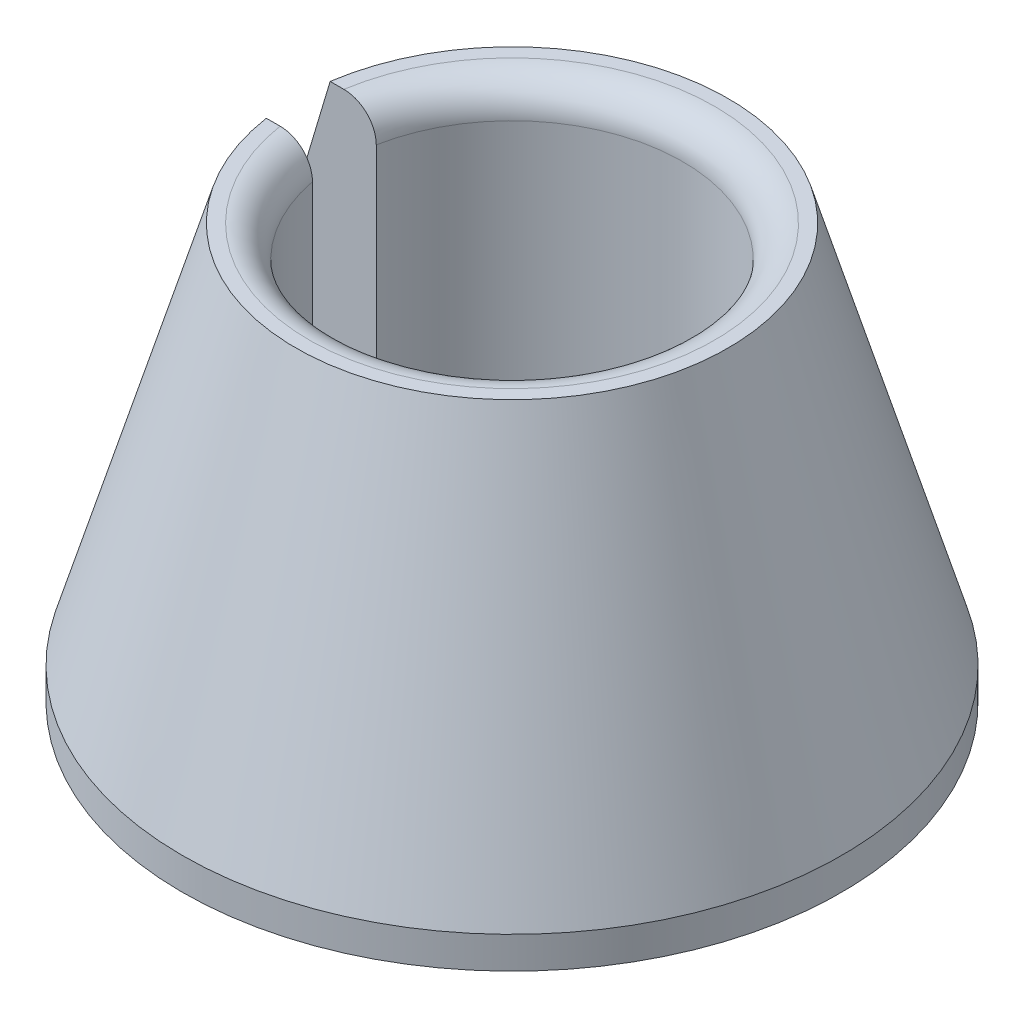
ISO-10303-21;
HEADER;
FILE_DESCRIPTION(('STEP AP214'),'2;1');
FILE_NAME('part.step','',(''),(''),'','','');
FILE_SCHEMA(('AUTOMOTIVE_DESIGN { 1 0 10303 214 1 1 1 1 }'));
ENDSEC;
DATA;
#1=APPLICATION_CONTEXT('core data for automotive mechanical design processes');
#2=APPLICATION_PROTOCOL_DEFINITION('international standard','automotive_design',2000,#1);
#3=PRODUCT_CONTEXT('',#1,'mechanical');
#4=PRODUCT('Part','Part','',(#3));
#5=PRODUCT_RELATED_PRODUCT_CATEGORY('part','',(#4));
#6=PRODUCT_DEFINITION_FORMATION('','',#4);
#7=PRODUCT_DEFINITION_CONTEXT('part definition',#1,'design');
#8=PRODUCT_DEFINITION('design','',#6,#7);
#9=PRODUCT_DEFINITION_SHAPE('','',#8);
#10=(LENGTH_UNIT() NAMED_UNIT(*) SI_UNIT(.MILLI.,.METRE.));
#11=(NAMED_UNIT(*) PLANE_ANGLE_UNIT() SI_UNIT($,.RADIAN.));
#12=(NAMED_UNIT(*) SI_UNIT($,.STERADIAN.) SOLID_ANGLE_UNIT());
#13=UNCERTAINTY_MEASURE_WITH_UNIT(LENGTH_MEASURE(1.E-05),#10,'distance_accuracy_value','');
#14=(GEOMETRIC_REPRESENTATION_CONTEXT(3) GLOBAL_UNCERTAINTY_ASSIGNED_CONTEXT((#13)) GLOBAL_UNIT_ASSIGNED_CONTEXT((#10,
#11,#12)) REPRESENTATION_CONTEXT('',''));
#15=CARTESIAN_POINT('',(0.,0.,0.));
#16=DIRECTION('',(0.,0.,1.));
#17=DIRECTION('',(1.,0.,0.));
#18=AXIS2_PLACEMENT_3D('',#15,#16,#17);
#19=CARTESIAN_POINT('',(0.,6.,0.));
#20=DIRECTION('',(0.,1.,0.));
#21=DIRECTION('',(0.,0.,1.));
#22=AXIS2_PLACEMENT_3D('',#19,#20,#21);
#23=PLANE('',#22);
#24=DIRECTION('',(-1.,0.,0.));
#25=VECTOR('',#24,1.);
#26=CARTESIAN_POINT('',(0.,6.,-0.5));
#27=LINE('',#26,#25);
#28=CARTESIAN_POINT('',(-3.13538275175456,6.,-0.5));
#29=VERTEX_POINT('',#28);
#30=CARTESIAN_POINT('',(-3.35061788745981,6.,-0.499999999999999));
#31=VERTEX_POINT('',#30);
#32=EDGE_CURVE('E111',#29,#31,#27,.T.);
#33=ORIENTED_EDGE('',*,*,#32,.F.);
#34=CARTESIAN_POINT('',(0.,6.,0.));
#35=DIRECTION('',(0.,1.,0.));
#36=DIRECTION('',(0.,0.,1.));
#37=AXIS2_PLACEMENT_3D('',#34,#35,#36);
#38=CIRCLE('',#37,3.175);
#39=CARTESIAN_POINT('',(-3.13538275175456,6.,0.5));
#40=VERTEX_POINT('',#39);
#41=EDGE_CURVE('E11',#29,#40,#38,.F.);
#42=ORIENTED_EDGE('',*,*,#41,.T.);
#43=DIRECTION('',(1.,0.,0.));
#44=VECTOR('',#43,1.);
#45=CARTESIAN_POINT('',(0.,6.,0.5));
#46=LINE('',#45,#44);
#47=CARTESIAN_POINT('',(-3.35061788745981,6.,0.5));
#48=VERTEX_POINT('',#47);
#49=EDGE_CURVE('E123',#48,#40,#46,.T.);
#50=ORIENTED_EDGE('',*,*,#49,.F.);
#51=CARTESIAN_POINT('',(0.,6.,0.));
#52=DIRECTION('',(0.,1.,0.));
#53=DIRECTION('',(0.,0.,1.));
#54=AXIS2_PLACEMENT_3D('',#51,#52,#53);
#55=CIRCLE('',#54,3.38771903022752);
#56=EDGE_CURVE('E132',#48,#31,#55,.T.);
#57=ORIENTED_EDGE('',*,*,#56,.T.);
#58=EDGE_LOOP('',(#33,#42,#50,#57));
#59=FACE_BOUND('',#58,.T.);
#60=ADVANCED_FACE('F30',(#59),#23,.T.);
#61=CARTESIAN_POINT('',(0.,6.,0.));
#62=DIRECTION('',(0.,-1.,0.));
#63=DIRECTION('',(0.,0.,-1.));
#64=AXIS2_PLACEMENT_3D('',#61,#62,#63);
#65=CYLINDRICAL_SURFACE('',#64,2.675);
#66=DIRECTION('',(0.,-1.,0.));
#67=VECTOR('',#66,1.);
#68=CARTESIAN_POINT('',(-2.62785558963958,6.,-0.5));
#69=LINE('',#68,#67);
#70=CARTESIAN_POINT('',(-2.62785558963958,0.,-0.5));
#71=VERTEX_POINT('',#70);
#72=CARTESIAN_POINT('',(-2.62785558963958,5.5,-0.5));
#73=VERTEX_POINT('',#72);
#74=EDGE_CURVE('E125',#71,#73,#69,.F.);
#75=ORIENTED_EDGE('',*,*,#74,.F.);
#76=CARTESIAN_POINT('',(0.,0.,0.));
#77=DIRECTION('',(0.,-1.,0.));
#78=DIRECTION('',(0.,0.,-1.));
#79=AXIS2_PLACEMENT_3D('',#76,#77,#78);
#80=CIRCLE('',#79,2.675);
#81=CARTESIAN_POINT('',(-2.62785558963958,0.,0.5));
#82=VERTEX_POINT('',#81);
#83=EDGE_CURVE('E52',#71,#82,#80,.T.);
#84=ORIENTED_EDGE('',*,*,#83,.T.);
#85=DIRECTION('',(0.,-1.,0.));
#86=VECTOR('',#85,1.);
#87=CARTESIAN_POINT('',(-2.62785558963958,6.,0.5));
#88=LINE('',#87,#86);
#89=CARTESIAN_POINT('',(-2.62785558963958,5.5,0.5));
#90=VERTEX_POINT('',#89);
#91=EDGE_CURVE('E128',#90,#82,#88,.T.);
#92=ORIENTED_EDGE('',*,*,#91,.F.);
#93=CARTESIAN_POINT('',(0.,5.5,0.));
#94=DIRECTION('',(0.,1.,0.));
#95=DIRECTION('',(0.,0.,1.));
#96=AXIS2_PLACEMENT_3D('',#93,#94,#95);
#97=CIRCLE('',#96,2.675);
#98=EDGE_CURVE('E199',#90,#73,#97,.T.);
#99=ORIENTED_EDGE('',*,*,#98,.T.);
#100=EDGE_LOOP('',(#75,#84,#92,#99));
#101=FACE_BOUND('',#100,.T.);
#102=ADVANCED_FACE('F153',(#101),#65,.F.);
#103=CARTESIAN_POINT('',(0.,6.,0.));
#104=DIRECTION('',(0.,-1.,0.));
#105=DIRECTION('',(0.,0.,-1.));
#106=AXIS2_PLACEMENT_3D('',#103,#104,#105);
#107=CONICAL_SURFACE('',#106,3.38771903022752,0.287979326579061);
#108=CARTESIAN_POINT('',(-7.06461862821965,-6.47266368919501,0.500000000000001));
#109=CARTESIAN_POINT('',(-6.70170207394919,-5.25062863502124,0.500000000000001));
#110=CARTESIAN_POINT('',(-6.33870617517651,-4.02861711105922,0.500000000000001));
#111=CARTESIAN_POINT('',(-5.61227249703137,-1.58471010621999,0.500000000000001));
#112=CARTESIAN_POINT('',(-5.2488347126165,-0.362814626841809,0.500000000000001));
#113=CARTESIAN_POINT('',(-4.52124265636424,2.08076235395059,0.500000000000001));
#114=CARTESIAN_POINT('',(-4.15708838499153,3.30244385550302,0.5));
#115=CARTESIAN_POINT('',(-3.60967078608585,5.13460575842493,0.5));
#116=CARTESIAN_POINT('',(-3.42700138317681,5.74526357395898,0.5));
#117=CARTESIAN_POINT('',(-3.06102299099385,6.96638853554709,0.5));
#118=CARTESIAN_POINT('',(-2.87771400094058,7.57685568136784,0.5));
#119=CARTESIAN_POINT('',(-2.57805380496822,8.57149014649971,0.5));
#120=CARTESIAN_POINT('',(-2.46204035942895,8.9557591954713,0.5));
#121=CARTESIAN_POINT('',(-2.22934094908726,9.72409247175238,0.5));
#122=CARTESIAN_POINT('',(-2.11265498660099,10.1081566997623,0.5));
#123=CARTESIAN_POINT('',(-1.93680490403009,10.6840057135758,0.5));
#124=CARTESIAN_POINT('',(-1.8780508852313,10.875915680973,0.5));
#125=CARTESIAN_POINT('',(-1.76017631875048,11.2596227257773,0.5));
#126=CARTESIAN_POINT('',(-1.70105577163703,11.451419803359,0.5));
#127=CARTESIAN_POINT('',(-1.58232680130916,11.8348655530353,0.5));
#128=CARTESIAN_POINT('',(-1.52271837261131,12.0265142234353,0.5));
#129=CARTESIAN_POINT('',(-1.40278787177882,12.409589122013,0.5));
#130=CARTESIAN_POINT('',(-1.34246579579467,12.6010153489846,0.5));
#131=CARTESIAN_POINT('',(-1.28167400377119,12.7922933816177,0.5));
#132=B_SPLINE_CURVE_WITH_KNOTS('',3,(#108,#109,#110,#111,#112,#113,#114,#115,#116,#117,#118,
#119,#120,#121,#122,#123,#124,#125,#126,#127,#128,#129,#130,#131),.UNSPECIFIED.,.F.,.F.,(4,2,2,
2,2,2,2,2,2,2,2,4),(0.,3.82435655263982,7.64875716273367,11.473155293271,13.3853370651035,
15.2975211677566,16.5017203408209,17.7059153691098,18.3080224115717,18.9101285202323,
19.5122414054505,20.1143575400337),.UNSPECIFIED.);
#133=CARTESIAN_POINT('',(-5.14074167800717,0.,0.500000000000003));
#134=VERTEX_POINT('',#133);
#135=EDGE_CURVE('E141',#134,#48,#132,.T.);
#136=ORIENTED_EDGE('',*,*,#135,.F.);
#137=CARTESIAN_POINT('',(0.,0.,0.));
#138=DIRECTION('',(0.,1.,0.));
#139=DIRECTION('',(0.,0.,1.));
#140=AXIS2_PLACEMENT_3D('',#137,#138,#139);
#141=CIRCLE('',#140,5.165);
#142=CARTESIAN_POINT('',(-5.14074167800715,0.,-0.499999999999999));
#143=VERTEX_POINT('',#142);
#144=EDGE_CURVE('E130',#134,#143,#141,.T.);
#145=ORIENTED_EDGE('',*,*,#144,.T.);
#146=CARTESIAN_POINT('',(-7.06461862821965,-6.47266368919501,-0.499999999999999));
#147=CARTESIAN_POINT('',(-6.70170207394919,-5.25062863502124,-0.499999999999999));
#148=CARTESIAN_POINT('',(-6.33870617517651,-4.02861711105922,-0.499999999999999));
#149=CARTESIAN_POINT('',(-5.61227249703137,-1.58471010621999,-0.499999999999999));
#150=CARTESIAN_POINT('',(-5.2488347126165,-0.362814626841809,-0.499999999999999));
#151=CARTESIAN_POINT('',(-4.52124265636424,2.08076235395059,-0.499999999999999));
#152=CARTESIAN_POINT('',(-4.15708838499153,3.30244385550302,-0.5));
#153=CARTESIAN_POINT('',(-3.60967078608585,5.13460575842493,-0.5));
#154=CARTESIAN_POINT('',(-3.42700138317681,5.74526357395898,-0.5));
#155=CARTESIAN_POINT('',(-3.06102299099385,6.96638853554709,-0.5));
#156=CARTESIAN_POINT('',(-2.87771400094058,7.57685568136784,-0.5));
#157=CARTESIAN_POINT('',(-2.57805380496822,8.57149014649971,-0.5));
#158=CARTESIAN_POINT('',(-2.46204035942895,8.9557591954713,-0.5));
#159=CARTESIAN_POINT('',(-2.22934094908726,9.72409247175238,-0.5));
#160=CARTESIAN_POINT('',(-2.11265498660099,10.1081566997623,-0.5));
#161=CARTESIAN_POINT('',(-1.93680490403009,10.6840057135758,-0.5));
#162=CARTESIAN_POINT('',(-1.8780508852313,10.875915680973,-0.5));
#163=CARTESIAN_POINT('',(-1.76017631875048,11.2596227257773,-0.5));
#164=CARTESIAN_POINT('',(-1.70105577163703,11.451419803359,-0.5));
#165=CARTESIAN_POINT('',(-1.58232680130916,11.8348655530353,-0.5));
#166=CARTESIAN_POINT('',(-1.52271837261131,12.0265142234353,-0.5));
#167=CARTESIAN_POINT('',(-1.40278787177882,12.409589122013,-0.5));
#168=CARTESIAN_POINT('',(-1.34246579579467,12.6010153489846,-0.5));
#169=CARTESIAN_POINT('',(-1.28167400377119,12.7922933816177,-0.5));
#170=B_SPLINE_CURVE_WITH_KNOTS('',3,(#146,#147,#148,#149,#150,#151,#152,#153,#154,#155,#156,
#157,#158,#159,#160,#161,#162,#163,#164,#165,#166,#167,#168,#169),.UNSPECIFIED.,.F.,.F.,(4,2,2,
2,2,2,2,2,2,2,2,4),(0.,3.82435655263982,7.64875716273367,11.473155293271,13.3853370651035,
15.2975211677566,16.5017203408209,17.7059153691098,18.3080224115717,18.9101285202322,
19.5122414054504,20.1143575400337),.UNSPECIFIED.);
#171=EDGE_CURVE('E108',#31,#143,#170,.F.);
#172=ORIENTED_EDGE('',*,*,#171,.F.);
#173=ORIENTED_EDGE('',*,*,#56,.F.);
#174=EDGE_LOOP('',(#136,#145,#172,#173));
#175=FACE_BOUND('',#174,.T.);
#176=ADVANCED_FACE('F149',(#175),#107,.T.);
#177=CARTESIAN_POINT('',(0.,0.,-0.5));
#178=DIRECTION('',(0.,0.,-1.));
#179=DIRECTION('',(-1.,0.,0.));
#180=AXIS2_PLACEMENT_3D('',#177,#178,#179);
#181=PLANE('',#180);
#182=DIRECTION('',(-1.,0.,0.));
#183=VECTOR('',#182,1.);
#184=CARTESIAN_POINT('',(-2.62785558963958,-0.5,-0.499999999999999));
#185=LINE('',#184,#183);
#186=CARTESIAN_POINT('',(-3.13538275175456,-0.5,-0.499999999999999));
#187=VERTEX_POINT('',#186);
#188=CARTESIAN_POINT('',(-5.14074167800715,-0.5,-0.499999999999999));
#189=VERTEX_POINT('',#188);
#190=EDGE_CURVE('E92',#187,#189,#185,.T.);
#191=ORIENTED_EDGE('',*,*,#190,.F.);
#192=CARTESIAN_POINT('',(-3.13538275175456,-0.5,-0.499999999999999));
#193=CARTESIAN_POINT('',(-3.10655092573426,-0.500022387888627,-0.499999999999999));
#194=CARTESIAN_POINT('',(-3.07772594842907,-0.497569316860611,-0.499999999999999));
#195=CARTESIAN_POINT('',(-3.02090359057727,-0.487887059755272,-0.5));
#196=CARTESIAN_POINT('',(-2.99290579989379,-0.480660283558117,-0.5));
#197=CARTESIAN_POINT('',(-2.93850708693991,-0.461600212774448,-0.5));
#198=CARTESIAN_POINT('',(-2.91210698989854,-0.449764560716097,-0.5));
#199=CARTESIAN_POINT('',(-2.86168343996578,-0.421816620357863,-0.5));
#200=CARTESIAN_POINT('',(-2.8376594436229,-0.405705313086703,-0.5));
#201=CARTESIAN_POINT('',(-2.79277788323548,-0.369712030058273,-0.5));
#202=CARTESIAN_POINT('',(-2.77190831247269,-0.349845035094705,-0.5));
#203=CARTESIAN_POINT('',(-2.73385112969764,-0.306841752140339,-0.5));
#204=CARTESIAN_POINT('',(-2.71666408873099,-0.283704958027437,-0.5));
#205=CARTESIAN_POINT('',(-2.68671756916732,-0.235149358076757,-0.5));
#206=CARTESIAN_POINT('',(-2.67390255987201,-0.209764765526068,-0.5));
#207=CARTESIAN_POINT('',(-2.65280381794522,-0.157187483088047,-0.5));
#208=CARTESIAN_POINT('',(-2.64451630456523,-0.129996323150408,-0.5));
#209=CARTESIAN_POINT('',(-2.63504587906835,-0.0854983516746654,-0.5));
#210=CARTESIAN_POINT('',(-2.63235125386808,-0.0684989991671761,-0.5));
#211=CARTESIAN_POINT('',(-2.62875648901823,-0.0343357793389331,-0.5));
#212=CARTESIAN_POINT('',(-2.62785383946479,-0.0171721760025874,-0.5));
#213=CARTESIAN_POINT('',(-2.6278555896389,-1.44781556411621E-13,-0.5));
#214=B_SPLINE_CURVE_WITH_KNOTS('',3,(#192,#193,#194,#195,#196,#197,#198,#199,#200,#201,#202,
#203,#204,#205,#206,#207,#208,#209,#210,#211,#212,#213),.UNSPECIFIED.,.F.,.F.,(4,2,2,2,2,2,2,2,
2,2,4),(0.,0.0863818756479679,0.172720176958453,0.259102699039588,0.345465418172967,
0.431490654808115,0.517529221637466,0.602430313669831,0.687260399066788,0.738808762382537,
0.790284874172521),.UNSPECIFIED.);
#215=EDGE_CURVE('E162',#187,#71,#214,.T.);
#216=ORIENTED_EDGE('',*,*,#215,.T.);
#217=ORIENTED_EDGE('',*,*,#74,.T.);
#218=CARTESIAN_POINT('',(-2.62785558963958,5.5,-0.5));
#219=CARTESIAN_POINT('',(-2.62782930286184,5.52779014956304,-0.5));
#220=CARTESIAN_POINT('',(-2.63021238983766,5.5555697193312,-0.5));
#221=CARTESIAN_POINT('',(-2.63959903252137,5.61030042380439,-0.5));
#222=CARTESIAN_POINT('',(-2.64659642102148,5.63725261408612,-0.5));
#223=CARTESIAN_POINT('',(-2.66501691977588,5.68960683115854,-0.5));
#224=CARTESIAN_POINT('',(-2.67644126471664,5.71500842319464,-0.5));
#225=CARTESIAN_POINT('',(-2.70335450523468,5.76355473599981,-0.5));
#226=CARTESIAN_POINT('',(-2.71884334962203,5.78669948518743,-0.5));
#227=CARTESIAN_POINT('',(-2.75357480939102,5.83029844233465,-0.5));
#228=CARTESIAN_POINT('',(-2.77284816388367,5.85072815166068,-0.5));
#229=CARTESIAN_POINT('',(-2.81450647534355,5.88812821535825,-0.5));
#230=CARTESIAN_POINT('',(-2.83689215944853,5.90509775903478,-0.5));
#231=CARTESIAN_POINT('',(-2.88452427881751,5.93537755317205,-0.5));
#232=CARTESIAN_POINT('',(-2.90981113082019,5.94862417310072,-0.5));
#233=CARTESIAN_POINT('',(-2.96222804533596,5.97073463839084,-0.5));
#234=CARTESIAN_POINT('',(-2.98935732218422,5.97960033872387,-0.5));
#235=CARTESIAN_POINT('',(-3.03640502276009,5.99075578457518,-0.5));
#236=CARTESIAN_POINT('',(-3.05605357519505,5.99421921326788,-0.5));
#237=CARTESIAN_POINT('',(-3.0955931000856,5.99884132866475,-0.5));
#238=CARTESIAN_POINT('',(-3.11548371225354,6.00000309877912,-0.5));
#239=CARTESIAN_POINT('',(-3.13538275175456,6.,-0.5));
#240=B_SPLINE_CURVE_WITH_KNOTS('',3,(#218,#219,#220,#221,#222,#223,#224,#225,#226,#227,#228,
#229,#230,#231,#232,#233,#234,#235,#236,#237,#238,#239),.UNSPECIFIED.,.F.,.F.,(4,2,2,2,2,2,2,2,
2,2,4),(0.,0.0832526519193971,0.166394258086513,0.249559069312963,0.332722833178664,
0.416592324650333,0.500481443693994,0.585727503365848,0.670937437104957,0.73066457263711,
0.790311640635817),.UNSPECIFIED.);
#241=EDGE_CURVE('E197',#73,#29,#240,.T.);
#242=ORIENTED_EDGE('',*,*,#241,.T.);
#243=ORIENTED_EDGE('',*,*,#32,.T.);
#244=ORIENTED_EDGE('',*,*,#171,.T.);
#245=DIRECTION('',(0.,1.,0.));
#246=VECTOR('',#245,1.);
#247=CARTESIAN_POINT('',(-5.14074167800715,-0.5,-0.499999999999999));
#248=LINE('',#247,#246);
#249=EDGE_CURVE('E105',#189,#143,#248,.T.);
#250=ORIENTED_EDGE('',*,*,#249,.F.);
#251=EDGE_LOOP('',(#191,#216,#217,#242,#243,#244,#250));
#252=FACE_BOUND('',#251,.T.);
#253=ADVANCED_FACE('F106',(#252),#181,.F.);
#254=CARTESIAN_POINT('',(0.,0.,0.5));
#255=DIRECTION('',(0.,0.,1.));
#256=DIRECTION('',(1.,0.,0.));
#257=AXIS2_PLACEMENT_3D('',#254,#255,#256);
#258=PLANE('',#257);
#259=ORIENTED_EDGE('',*,*,#91,.T.);
#260=CARTESIAN_POINT('',(-2.62785558963958,0.,0.5));
#261=CARTESIAN_POINT('',(-2.62782930286184,-0.0277901495630432,0.5));
#262=CARTESIAN_POINT('',(-2.63021238983766,-0.0555697193312038,0.5));
#263=CARTESIAN_POINT('',(-2.63959903252137,-0.110300423804393,0.5));
#264=CARTESIAN_POINT('',(-2.64659642102148,-0.137252614086121,0.5));
#265=CARTESIAN_POINT('',(-2.66501691977588,-0.189606831158536,0.5));
#266=CARTESIAN_POINT('',(-2.67644126471664,-0.21500842319464,0.5));
#267=CARTESIAN_POINT('',(-2.70335450523469,-0.263554735999812,0.5));
#268=CARTESIAN_POINT('',(-2.71884334962203,-0.28669948518743,0.5));
#269=CARTESIAN_POINT('',(-2.75357480939102,-0.330298442334654,0.5));
#270=CARTESIAN_POINT('',(-2.77284816388367,-0.350728151660678,0.5));
#271=CARTESIAN_POINT('',(-2.81450647534355,-0.388128215358249,0.5));
#272=CARTESIAN_POINT('',(-2.83689215944853,-0.405097759034776,0.5));
#273=CARTESIAN_POINT('',(-2.88452427881751,-0.435377553172055,0.5));
#274=CARTESIAN_POINT('',(-2.90981113082019,-0.448624173100724,0.5));
#275=CARTESIAN_POINT('',(-2.96222804533596,-0.470734638390839,0.5));
#276=CARTESIAN_POINT('',(-2.98935732218422,-0.479600338723875,0.5));
#277=CARTESIAN_POINT('',(-3.03640502276009,-0.490755784575177,0.5));
#278=CARTESIAN_POINT('',(-3.05605357519505,-0.494219213267876,0.5));
#279=CARTESIAN_POINT('',(-3.0955931000856,-0.498841328664747,0.5));
#280=CARTESIAN_POINT('',(-3.11548371225354,-0.500003098779125,0.5));
#281=CARTESIAN_POINT('',(-3.13538275175456,-0.5,0.5));
#282=B_SPLINE_CURVE_WITH_KNOTS('',3,(#260,#261,#262,#263,#264,#265,#266,#267,#268,#269,#270,
#271,#272,#273,#274,#275,#276,#277,#278,#279,#280,#281),.UNSPECIFIED.,.F.,.F.,(4,2,2,2,2,2,2,2,
2,2,4),(0.,0.0832526519193976,0.166394258086514,0.249559069312964,0.332722833178664,
0.416592324650333,0.500481443693994,0.585727503365849,0.670937437104958,0.730664572637112,
0.790311640635818),.UNSPECIFIED.);
#283=CARTESIAN_POINT('',(-3.13538275175456,-0.5,0.500000000000001));
#284=VERTEX_POINT('',#283);
#285=EDGE_CURVE('E39',#82,#284,#282,.T.);
#286=ORIENTED_EDGE('',*,*,#285,.T.);
#287=DIRECTION('',(1.,0.,0.));
#288=VECTOR('',#287,1.);
#289=CARTESIAN_POINT('',(-2.62785558963958,-0.5,0.5));
#290=LINE('',#289,#288);
#291=CARTESIAN_POINT('',(-5.14074167800716,-0.5,0.500000000000003));
#292=VERTEX_POINT('',#291);
#293=EDGE_CURVE('E117',#292,#284,#290,.T.);
#294=ORIENTED_EDGE('',*,*,#293,.F.);
#295=DIRECTION('',(0.,1.,0.));
#296=VECTOR('',#295,1.);
#297=CARTESIAN_POINT('',(-5.14074167800716,-0.5,0.500000000000003));
#298=LINE('',#297,#296);
#299=EDGE_CURVE('E112',#292,#134,#298,.T.);
#300=ORIENTED_EDGE('',*,*,#299,.T.);
#301=ORIENTED_EDGE('',*,*,#135,.T.);
#302=ORIENTED_EDGE('',*,*,#49,.T.);
#303=CARTESIAN_POINT('',(-3.13538275175456,6.,0.5));
#304=CARTESIAN_POINT('',(-3.10655092573426,6.00002238788863,0.5));
#305=CARTESIAN_POINT('',(-3.07772594842907,5.99756931686061,0.5));
#306=CARTESIAN_POINT('',(-3.02090359057727,5.98788705975527,0.5));
#307=CARTESIAN_POINT('',(-2.99290579989379,5.98066028355812,0.5));
#308=CARTESIAN_POINT('',(-2.93850708693991,5.96160021277445,0.5));
#309=CARTESIAN_POINT('',(-2.91210698989854,5.9497645607161,0.5));
#310=CARTESIAN_POINT('',(-2.86168343996578,5.92181662035786,0.5));
#311=CARTESIAN_POINT('',(-2.8376594436229,5.9057053130867,0.5));
#312=CARTESIAN_POINT('',(-2.79277788323548,5.86971203005827,0.5));
#313=CARTESIAN_POINT('',(-2.77190831247269,5.8498450350947,0.5));
#314=CARTESIAN_POINT('',(-2.73385112969764,5.80684175214034,0.5));
#315=CARTESIAN_POINT('',(-2.71666408873099,5.78370495802744,0.5));
#316=CARTESIAN_POINT('',(-2.68671756916732,5.73514935807676,0.5));
#317=CARTESIAN_POINT('',(-2.67390255987201,5.70976476552607,0.5));
#318=CARTESIAN_POINT('',(-2.65280381794522,5.65718748308805,0.5));
#319=CARTESIAN_POINT('',(-2.64451630456523,5.62999632315041,0.5));
#320=CARTESIAN_POINT('',(-2.63504587906835,5.58549835167467,0.5));
#321=CARTESIAN_POINT('',(-2.63235125386808,5.56849899916718,0.5));
#322=CARTESIAN_POINT('',(-2.62875648901822,5.53433577933893,0.5));
#323=CARTESIAN_POINT('',(-2.62785383946479,5.51717217600259,0.5));
#324=CARTESIAN_POINT('',(-2.6278555896389,5.50000000000015,0.5));
#325=B_SPLINE_CURVE_WITH_KNOTS('',3,(#303,#304,#305,#306,#307,#308,#309,#310,#311,#312,#313,
#314,#315,#316,#317,#318,#319,#320,#321,#322,#323,#324),.UNSPECIFIED.,.F.,.F.,(4,2,2,2,2,2,2,2,
2,2,4),(0.,0.0863818756479684,0.172720176958454,0.25910269903959,0.345465418172968,
0.431490654808116,0.517529221637466,0.602430313669832,0.687260399066788,0.738808762382536,
0.79028487417252),.UNSPECIFIED.);
#326=EDGE_CURVE('E172',#40,#90,#325,.T.);
#327=ORIENTED_EDGE('',*,*,#326,.T.);
#328=EDGE_LOOP('',(#259,#286,#294,#300,#301,#302,#327));
#329=FACE_BOUND('',#328,.T.);
#330=ADVANCED_FACE('F177',(#329),#258,.F.);
#331=CARTESIAN_POINT('',(0.,-0.5,0.));
#332=DIRECTION('',(0.,1.,0.));
#333=DIRECTION('',(0.,0.,1.));
#334=AXIS2_PLACEMENT_3D('',#331,#332,#333);
#335=CYLINDRICAL_SURFACE('',#334,5.16499999999999);
#336=ORIENTED_EDGE('',*,*,#144,.F.);
#337=ORIENTED_EDGE('',*,*,#299,.F.);
#338=CARTESIAN_POINT('',(0.,-0.5,0.));
#339=DIRECTION('',(0.,-1.,0.));
#340=DIRECTION('',(0.,0.,-1.));
#341=AXIS2_PLACEMENT_3D('',#338,#339,#340);
#342=CIRCLE('',#341,5.16499999999999);
#343=EDGE_CURVE('E97',#189,#292,#342,.T.);
#344=ORIENTED_EDGE('',*,*,#343,.F.);
#345=ORIENTED_EDGE('',*,*,#249,.T.);
#346=EDGE_LOOP('',(#336,#337,#344,#345));
#347=FACE_BOUND('',#346,.T.);
#348=ADVANCED_FACE('F114',(#347),#335,.T.);
#349=CARTESIAN_POINT('',(0.,-0.5,0.));
#350=DIRECTION('',(0.,-1.,0.));
#351=DIRECTION('',(0.,0.,-1.));
#352=AXIS2_PLACEMENT_3D('',#349,#350,#351);
#353=PLANE('',#352);
#354=ORIENTED_EDGE('',*,*,#293,.T.);
#355=CARTESIAN_POINT('',(0.,-0.5,0.));
#356=DIRECTION('',(0.,-1.,0.));
#357=DIRECTION('',(0.,0.,-1.));
#358=AXIS2_PLACEMENT_3D('',#355,#356,#357);
#359=CIRCLE('',#358,3.175);
#360=EDGE_CURVE('E100',#284,#187,#359,.F.);
#361=ORIENTED_EDGE('',*,*,#360,.T.);
#362=ORIENTED_EDGE('',*,*,#190,.T.);
#363=ORIENTED_EDGE('',*,*,#343,.T.);
#364=EDGE_LOOP('',(#354,#361,#362,#363));
#365=FACE_BOUND('',#364,.T.);
#366=ADVANCED_FACE('F95',(#365),#353,.T.);
#367=CARTESIAN_POINT('',(0.,0.,0.));
#368=DIRECTION('',(0.,-1.,0.));
#369=DIRECTION('',(0.,0.,-1.));
#370=AXIS2_PLACEMENT_3D('',#367,#368,#369);
#371=TOROIDAL_SURFACE('',#370,3.175,0.5);
#372=ORIENTED_EDGE('',*,*,#285,.F.);
#373=ORIENTED_EDGE('',*,*,#83,.F.);
#374=ORIENTED_EDGE('',*,*,#215,.F.);
#375=ORIENTED_EDGE('',*,*,#360,.F.);
#376=EDGE_LOOP('',(#372,#373,#374,#375));
#377=FACE_BOUND('',#376,.T.);
#378=ADVANCED_FACE('F155',(#377),#371,.T.);
#379=CARTESIAN_POINT('',(0.,5.5,0.));
#380=DIRECTION('',(0.,1.,0.));
#381=DIRECTION('',(0.,0.,1.));
#382=AXIS2_PLACEMENT_3D('',#379,#380,#381);
#383=TOROIDAL_SURFACE('',#382,3.175,0.5);
#384=ORIENTED_EDGE('',*,*,#326,.F.);
#385=ORIENTED_EDGE('',*,*,#41,.F.);
#386=ORIENTED_EDGE('',*,*,#241,.F.);
#387=ORIENTED_EDGE('',*,*,#98,.F.);
#388=EDGE_LOOP('',(#384,#385,#386,#387));
#389=FACE_BOUND('',#388,.T.);
#390=ADVANCED_FACE('F32',(#389),#383,.T.);
#391=CLOSED_SHELL('',(#60,#102,#176,#253,#330,#348,#366,#378,#390));
#392=MANIFOLD_SOLID_BREP('B2',#391);
#393=ADVANCED_BREP_SHAPE_REPRESENTATION('',(#18,#392),#14);
#394=SHAPE_DEFINITION_REPRESENTATION(#9,#393);
ENDSEC;
END-ISO-10303-21;
